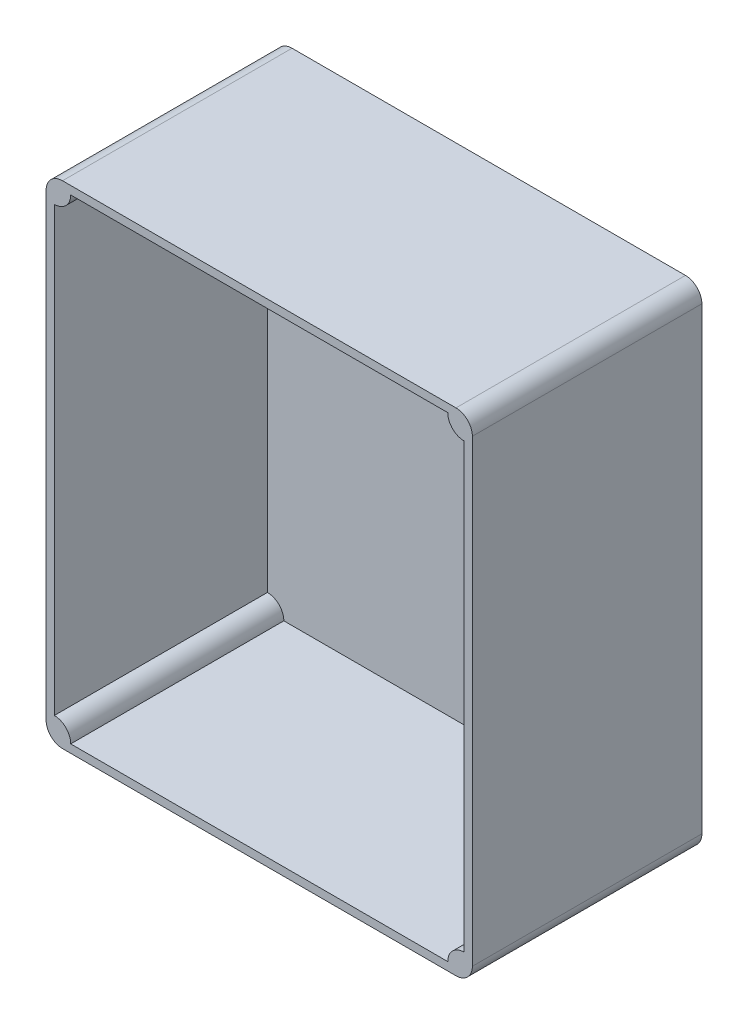
ISO-10303-21;
HEADER;
FILE_DESCRIPTION(('STEP AP214'),'2;1');
FILE_NAME('part.step','',(''),(''),'','','');
FILE_SCHEMA(('AUTOMOTIVE_DESIGN { 1 0 10303 214 1 1 1 1 }'));
ENDSEC;
DATA;
#1=APPLICATION_CONTEXT('core data for automotive mechanical design processes');
#2=APPLICATION_PROTOCOL_DEFINITION('international standard','automotive_design',2000,#1);
#3=PRODUCT_CONTEXT('',#1,'mechanical');
#4=PRODUCT('Part','Part','',(#3));
#5=PRODUCT_RELATED_PRODUCT_CATEGORY('part','',(#4));
#6=PRODUCT_DEFINITION_FORMATION('','',#4);
#7=PRODUCT_DEFINITION_CONTEXT('part definition',#1,'design');
#8=PRODUCT_DEFINITION('design','',#6,#7);
#9=PRODUCT_DEFINITION_SHAPE('','',#8);
#10=(LENGTH_UNIT() NAMED_UNIT(*) SI_UNIT(.MILLI.,.METRE.));
#11=(NAMED_UNIT(*) PLANE_ANGLE_UNIT() SI_UNIT($,.RADIAN.));
#12=(NAMED_UNIT(*) SI_UNIT($,.STERADIAN.) SOLID_ANGLE_UNIT());
#13=UNCERTAINTY_MEASURE_WITH_UNIT(LENGTH_MEASURE(1.E-05),#10,'distance_accuracy_value','');
#14=(GEOMETRIC_REPRESENTATION_CONTEXT(3) GLOBAL_UNCERTAINTY_ASSIGNED_CONTEXT((#13)) GLOBAL_UNIT_ASSIGNED_CONTEXT((#10,
#11,#12)) REPRESENTATION_CONTEXT('',''));
#15=CARTESIAN_POINT('',(0.,0.,0.));
#16=DIRECTION('',(0.,0.,1.));
#17=DIRECTION('',(1.,0.,0.));
#18=AXIS2_PLACEMENT_3D('',#15,#16,#17);
#19=CARTESIAN_POINT('',(0.,0.,35.));
#20=DIRECTION('',(0.,0.,1.));
#21=DIRECTION('',(1.,0.,0.));
#22=AXIS2_PLACEMENT_3D('',#19,#20,#21);
#23=PLANE('',#22);
#24=DIRECTION('',(-1.,0.,0.));
#25=VECTOR('',#24,1.);
#26=CARTESIAN_POINT('',(-65.,75.,35.));
#27=LINE('',#26,#25);
#28=CARTESIAN_POINT('',(60.,75.,35.));
#29=VERTEX_POINT('',#28);
#30=CARTESIAN_POINT('',(-60.,75.,35.));
#31=VERTEX_POINT('',#30);
#32=EDGE_CURVE('E255',#29,#31,#27,.T.);
#33=ORIENTED_EDGE('',*,*,#32,.T.);
#34=CARTESIAN_POINT('',(-60.,70.,35.));
#35=DIRECTION('',(0.,0.,1.));
#36=DIRECTION('',(1.,0.,0.));
#37=AXIS2_PLACEMENT_3D('',#34,#35,#36);
#38=CIRCLE('',#37,5.);
#39=CARTESIAN_POINT('',(-65.,70.,35.));
#40=VERTEX_POINT('',#39);
#41=EDGE_CURVE('E313',#31,#40,#38,.T.);
#42=ORIENTED_EDGE('',*,*,#41,.T.);
#43=DIRECTION('',(0.,-1.,0.));
#44=VECTOR('',#43,1.);
#45=CARTESIAN_POINT('',(-65.,75.,35.));
#46=LINE('',#45,#44);
#47=CARTESIAN_POINT('',(-65.,-70.,35.));
#48=VERTEX_POINT('',#47);
#49=EDGE_CURVE('E260',#40,#48,#46,.T.);
#50=ORIENTED_EDGE('',*,*,#49,.T.);
#51=CARTESIAN_POINT('',(-60.,-70.,35.));
#52=DIRECTION('',(0.,0.,1.));
#53=DIRECTION('',(1.,0.,0.));
#54=AXIS2_PLACEMENT_3D('',#51,#52,#53);
#55=CIRCLE('',#54,5.);
#56=CARTESIAN_POINT('',(-60.,-75.,35.));
#57=VERTEX_POINT('',#56);
#58=EDGE_CURVE('E60',#48,#57,#55,.T.);
#59=ORIENTED_EDGE('',*,*,#58,.T.);
#60=DIRECTION('',(1.,0.,0.));
#61=VECTOR('',#60,1.);
#62=CARTESIAN_POINT('',(-65.,-75.,35.));
#63=LINE('',#62,#61);
#64=CARTESIAN_POINT('',(60.,-75.,35.));
#65=VERTEX_POINT('',#64);
#66=EDGE_CURVE('E263',#57,#65,#63,.T.);
#67=ORIENTED_EDGE('',*,*,#66,.T.);
#68=CARTESIAN_POINT('',(60.,-70.,35.));
#69=DIRECTION('',(0.,0.,1.));
#70=DIRECTION('',(1.,0.,0.));
#71=AXIS2_PLACEMENT_3D('',#68,#69,#70);
#72=CIRCLE('',#71,5.);
#73=CARTESIAN_POINT('',(65.,-70.,35.));
#74=VERTEX_POINT('',#73);
#75=EDGE_CURVE('E307',#65,#74,#72,.T.);
#76=ORIENTED_EDGE('',*,*,#75,.T.);
#77=DIRECTION('',(0.,1.,0.));
#78=VECTOR('',#77,1.);
#79=CARTESIAN_POINT('',(65.,75.,35.));
#80=LINE('',#79,#78);
#81=CARTESIAN_POINT('',(65.,70.,35.));
#82=VERTEX_POINT('',#81);
#83=EDGE_CURVE('E251',#74,#82,#80,.T.);
#84=ORIENTED_EDGE('',*,*,#83,.T.);
#85=CARTESIAN_POINT('',(60.,70.,35.));
#86=DIRECTION('',(0.,0.,1.));
#87=DIRECTION('',(1.,0.,0.));
#88=AXIS2_PLACEMENT_3D('',#85,#86,#87);
#89=CIRCLE('',#88,5.);
#90=EDGE_CURVE('E310',#82,#29,#89,.T.);
#91=ORIENTED_EDGE('',*,*,#90,.T.);
#92=EDGE_LOOP('',(#33,#42,#50,#59,#67,#76,#84,#91));
#93=FACE_BOUND('',#92,.T.);
#94=DIRECTION('',(1.,0.,0.));
#95=VECTOR('',#94,1.);
#96=CARTESIAN_POINT('',(0.,72.5,35.));
#97=LINE('',#96,#95);
#98=CARTESIAN_POINT('',(-57.5,72.5,35.));
#99=VERTEX_POINT('',#98);
#100=CARTESIAN_POINT('',(57.5,72.5,35.));
#101=VERTEX_POINT('',#100);
#102=EDGE_CURVE('E208',#99,#101,#97,.T.);
#103=ORIENTED_EDGE('',*,*,#102,.T.);
#104=CARTESIAN_POINT('',(62.5,72.5,35.));
#105=DIRECTION('',(0.,0.,1.));
#106=DIRECTION('',(1.,0.,0.));
#107=AXIS2_PLACEMENT_3D('',#104,#105,#106);
#108=CIRCLE('',#107,5.);
#109=CARTESIAN_POINT('',(62.5,67.5,35.));
#110=VERTEX_POINT('',#109);
#111=EDGE_CURVE('E174',#101,#110,#108,.T.);
#112=ORIENTED_EDGE('',*,*,#111,.T.);
#113=DIRECTION('',(0.,-1.,0.));
#114=VECTOR('',#113,1.);
#115=CARTESIAN_POINT('',(62.5,0.,35.));
#116=LINE('',#115,#114);
#117=CARTESIAN_POINT('',(62.5,-67.5,35.));
#118=VERTEX_POINT('',#117);
#119=EDGE_CURVE('E181',#110,#118,#116,.T.);
#120=ORIENTED_EDGE('',*,*,#119,.T.);
#121=CARTESIAN_POINT('',(62.5,-72.5,35.));
#122=DIRECTION('',(0.,0.,1.));
#123=DIRECTION('',(1.,0.,0.));
#124=AXIS2_PLACEMENT_3D('',#121,#122,#123);
#125=CIRCLE('',#124,5.);
#126=CARTESIAN_POINT('',(57.5,-72.5,35.));
#127=VERTEX_POINT('',#126);
#128=EDGE_CURVE('E185',#118,#127,#125,.T.);
#129=ORIENTED_EDGE('',*,*,#128,.T.);
#130=DIRECTION('',(1.,0.,0.));
#131=VECTOR('',#130,1.);
#132=CARTESIAN_POINT('',(0.,-72.5,35.));
#133=LINE('',#132,#131);
#134=CARTESIAN_POINT('',(-57.5,-72.5,35.));
#135=VERTEX_POINT('',#134);
#136=EDGE_CURVE('E223',#135,#127,#133,.T.);
#137=ORIENTED_EDGE('',*,*,#136,.F.);
#138=CARTESIAN_POINT('',(-62.5,-72.5,35.));
#139=DIRECTION('',(0.,0.,1.));
#140=DIRECTION('',(1.,0.,0.));
#141=AXIS2_PLACEMENT_3D('',#138,#139,#140);
#142=CIRCLE('',#141,5.);
#143=CARTESIAN_POINT('',(-62.5,-67.5,35.));
#144=VERTEX_POINT('',#143);
#145=EDGE_CURVE('E219',#135,#144,#142,.T.);
#146=ORIENTED_EDGE('',*,*,#145,.T.);
#147=DIRECTION('',(0.,-1.,0.));
#148=VECTOR('',#147,1.);
#149=CARTESIAN_POINT('',(-62.5,0.,35.));
#150=LINE('',#149,#148);
#151=CARTESIAN_POINT('',(-62.5,67.5,35.));
#152=VERTEX_POINT('',#151);
#153=EDGE_CURVE('E215',#152,#144,#150,.T.);
#154=ORIENTED_EDGE('',*,*,#153,.F.);
#155=CARTESIAN_POINT('',(-62.5,72.5,35.));
#156=DIRECTION('',(0.,0.,1.));
#157=DIRECTION('',(1.,0.,0.));
#158=AXIS2_PLACEMENT_3D('',#155,#156,#157);
#159=CIRCLE('',#158,5.);
#160=EDGE_CURVE('E211',#99,#152,#159,.F.);
#161=ORIENTED_EDGE('',*,*,#160,.F.);
#162=EDGE_LOOP('',(#103,#112,#120,#129,#137,#146,#154,#161));
#163=FACE_BOUND('',#162,.T.);
#164=ADVANCED_FACE('F39',(#93,#163),#23,.T.);
#165=CARTESIAN_POINT('',(65.,75.,35.));
#166=DIRECTION('',(-1.,0.,0.));
#167=DIRECTION('',(0.,-1.,0.));
#168=AXIS2_PLACEMENT_3D('',#165,#166,#167);
#169=PLANE('',#168);
#170=DIRECTION('',(0.,1.,0.));
#171=VECTOR('',#170,1.);
#172=CARTESIAN_POINT('',(65.,75.,-35.));
#173=LINE('',#172,#171);
#174=CARTESIAN_POINT('',(65.,-70.,-35.));
#175=VERTEX_POINT('',#174);
#176=CARTESIAN_POINT('',(65.,70.,-35.));
#177=VERTEX_POINT('',#176);
#178=EDGE_CURVE('E233',#175,#177,#173,.T.);
#179=ORIENTED_EDGE('',*,*,#178,.T.);
#180=DIRECTION('',(0.,0.,-1.));
#181=VECTOR('',#180,1.);
#182=CARTESIAN_POINT('',(65.,70.,35.));
#183=LINE('',#182,#181);
#184=EDGE_CURVE('E320',#177,#82,#183,.F.);
#185=ORIENTED_EDGE('',*,*,#184,.T.);
#186=ORIENTED_EDGE('',*,*,#83,.F.);
#187=DIRECTION('',(0.,0.,-1.));
#188=VECTOR('',#187,1.);
#189=CARTESIAN_POINT('',(65.,-70.,35.));
#190=LINE('',#189,#188);
#191=EDGE_CURVE('E316',#74,#175,#190,.T.);
#192=ORIENTED_EDGE('',*,*,#191,.T.);
#193=EDGE_LOOP('',(#179,#185,#186,#192));
#194=FACE_BOUND('',#193,.T.);
#195=ADVANCED_FACE('F338',(#194),#169,.F.);
#196=CARTESIAN_POINT('',(-65.,75.,35.));
#197=DIRECTION('',(0.,-1.,0.));
#198=DIRECTION('',(0.,0.,-1.));
#199=AXIS2_PLACEMENT_3D('',#196,#197,#198);
#200=PLANE('',#199);
#201=DIRECTION('',(-1.,0.,0.));
#202=VECTOR('',#201,1.);
#203=CARTESIAN_POINT('',(-65.,75.,-35.));
#204=LINE('',#203,#202);
#205=CARTESIAN_POINT('',(60.,75.,-35.));
#206=VERTEX_POINT('',#205);
#207=CARTESIAN_POINT('',(-60.,75.,-35.));
#208=VERTEX_POINT('',#207);
#209=EDGE_CURVE('E270',#206,#208,#204,.T.);
#210=ORIENTED_EDGE('',*,*,#209,.T.);
#211=DIRECTION('',(0.,0.,-1.));
#212=VECTOR('',#211,1.);
#213=CARTESIAN_POINT('',(-60.,75.,35.));
#214=LINE('',#213,#212);
#215=EDGE_CURVE('E302',#208,#31,#214,.F.);
#216=ORIENTED_EDGE('',*,*,#215,.T.);
#217=ORIENTED_EDGE('',*,*,#32,.F.);
#218=DIRECTION('',(0.,0.,-1.));
#219=VECTOR('',#218,1.);
#220=CARTESIAN_POINT('',(60.,75.,35.));
#221=LINE('',#220,#219);
#222=EDGE_CURVE('E298',#29,#206,#221,.T.);
#223=ORIENTED_EDGE('',*,*,#222,.T.);
#224=EDGE_LOOP('',(#210,#216,#217,#223));
#225=FACE_BOUND('',#224,.T.);
#226=ADVANCED_FACE('F348',(#225),#200,.F.);
#227=CARTESIAN_POINT('',(-65.,75.,35.));
#228=DIRECTION('',(1.,0.,0.));
#229=DIRECTION('',(0.,1.,0.));
#230=AXIS2_PLACEMENT_3D('',#227,#228,#229);
#231=PLANE('',#230);
#232=ORIENTED_EDGE('',*,*,#49,.F.);
#233=DIRECTION('',(0.,0.,-1.));
#234=VECTOR('',#233,1.);
#235=CARTESIAN_POINT('',(-65.,70.,35.));
#236=LINE('',#235,#234);
#237=CARTESIAN_POINT('',(-65.,70.,-35.));
#238=VERTEX_POINT('',#237);
#239=EDGE_CURVE('E282',#40,#238,#236,.T.);
#240=ORIENTED_EDGE('',*,*,#239,.T.);
#241=DIRECTION('',(0.,-1.,0.));
#242=VECTOR('',#241,1.);
#243=CARTESIAN_POINT('',(-65.,75.,-35.));
#244=LINE('',#243,#242);
#245=CARTESIAN_POINT('',(-65.,-70.,-35.));
#246=VERTEX_POINT('',#245);
#247=EDGE_CURVE('E274',#238,#246,#244,.T.);
#248=ORIENTED_EDGE('',*,*,#247,.T.);
#249=DIRECTION('',(0.,0.,-1.));
#250=VECTOR('',#249,1.);
#251=CARTESIAN_POINT('',(-65.,-70.,35.));
#252=LINE('',#251,#250);
#253=EDGE_CURVE('E266',#246,#48,#252,.F.);
#254=ORIENTED_EDGE('',*,*,#253,.T.);
#255=EDGE_LOOP('',(#232,#240,#248,#254));
#256=FACE_BOUND('',#255,.T.);
#257=ADVANCED_FACE('F356',(#256),#231,.F.);
#258=CARTESIAN_POINT('',(-65.,-75.,35.));
#259=DIRECTION('',(0.,1.,0.));
#260=DIRECTION('',(0.,0.,1.));
#261=AXIS2_PLACEMENT_3D('',#258,#259,#260);
#262=PLANE('',#261);
#263=DIRECTION('',(1.,0.,0.));
#264=VECTOR('',#263,1.);
#265=CARTESIAN_POINT('',(-65.,-75.,-35.));
#266=LINE('',#265,#264);
#267=CARTESIAN_POINT('',(-60.,-75.,-35.));
#268=VERTEX_POINT('',#267);
#269=CARTESIAN_POINT('',(60.,-75.,-35.));
#270=VERTEX_POINT('',#269);
#271=EDGE_CURVE('E256',#268,#270,#266,.T.);
#272=ORIENTED_EDGE('',*,*,#271,.T.);
#273=DIRECTION('',(0.,0.,-1.));
#274=VECTOR('',#273,1.);
#275=CARTESIAN_POINT('',(60.,-75.,35.));
#276=LINE('',#275,#274);
#277=EDGE_CURVE('E11',#270,#65,#276,.F.);
#278=ORIENTED_EDGE('',*,*,#277,.T.);
#279=ORIENTED_EDGE('',*,*,#66,.F.);
#280=DIRECTION('',(0.,0.,-1.));
#281=VECTOR('',#280,1.);
#282=CARTESIAN_POINT('',(-60.,-75.,35.));
#283=LINE('',#282,#281);
#284=EDGE_CURVE('E48',#57,#268,#283,.T.);
#285=ORIENTED_EDGE('',*,*,#284,.T.);
#286=EDGE_LOOP('',(#272,#278,#279,#285));
#287=FACE_BOUND('',#286,.T.);
#288=ADVANCED_FACE('F326',(#287),#262,.F.);
#289=CARTESIAN_POINT('',(0.,0.,-35.));
#290=DIRECTION('',(0.,0.,1.));
#291=DIRECTION('',(1.,0.,0.));
#292=AXIS2_PLACEMENT_3D('',#289,#290,#291);
#293=PLANE('',#292);
#294=ORIENTED_EDGE('',*,*,#247,.F.);
#295=CARTESIAN_POINT('',(-60.,70.,-35.));
#296=DIRECTION('',(0.,0.,1.));
#297=DIRECTION('',(1.,0.,0.));
#298=AXIS2_PLACEMENT_3D('',#295,#296,#297);
#299=CIRCLE('',#298,5.);
#300=EDGE_CURVE('E295',#238,#208,#299,.F.);
#301=ORIENTED_EDGE('',*,*,#300,.T.);
#302=ORIENTED_EDGE('',*,*,#209,.F.);
#303=CARTESIAN_POINT('',(60.,70.,-35.));
#304=DIRECTION('',(0.,0.,1.));
#305=DIRECTION('',(1.,0.,0.));
#306=AXIS2_PLACEMENT_3D('',#303,#304,#305);
#307=CIRCLE('',#306,5.);
#308=EDGE_CURVE('E292',#206,#177,#307,.F.);
#309=ORIENTED_EDGE('',*,*,#308,.T.);
#310=ORIENTED_EDGE('',*,*,#178,.F.);
#311=CARTESIAN_POINT('',(60.,-70.,-35.));
#312=DIRECTION('',(0.,0.,1.));
#313=DIRECTION('',(1.,0.,0.));
#314=AXIS2_PLACEMENT_3D('',#311,#312,#313);
#315=CIRCLE('',#314,5.);
#316=EDGE_CURVE('E289',#175,#270,#315,.F.);
#317=ORIENTED_EDGE('',*,*,#316,.T.);
#318=ORIENTED_EDGE('',*,*,#271,.F.);
#319=CARTESIAN_POINT('',(-60.,-70.,-35.));
#320=DIRECTION('',(0.,0.,1.));
#321=DIRECTION('',(1.,0.,0.));
#322=AXIS2_PLACEMENT_3D('',#319,#320,#321);
#323=CIRCLE('',#322,5.);
#324=EDGE_CURVE('E286',#268,#246,#323,.F.);
#325=ORIENTED_EDGE('',*,*,#324,.T.);
#326=EDGE_LOOP('',(#294,#301,#302,#309,#310,#317,#318,#325));
#327=FACE_BOUND('',#326,.T.);
#328=ADVANCED_FACE('F330',(#327),#293,.F.);
#329=CARTESIAN_POINT('',(62.5,72.5,-30.));
#330=DIRECTION('',(0.,0.,1.));
#331=DIRECTION('',(1.,0.,0.));
#332=AXIS2_PLACEMENT_3D('',#329,#330,#331);
#333=CYLINDRICAL_SURFACE('',#332,5.);
#334=ORIENTED_EDGE('',*,*,#111,.F.);
#335=DIRECTION('',(0.,0.,1.));
#336=VECTOR('',#335,1.);
#337=CARTESIAN_POINT('',(57.5,72.5,-30.));
#338=LINE('',#337,#336);
#339=CARTESIAN_POINT('',(57.5,72.5,-30.));
#340=VERTEX_POINT('',#339);
#341=EDGE_CURVE('E157',#340,#101,#338,.T.);
#342=ORIENTED_EDGE('',*,*,#341,.F.);
#343=CARTESIAN_POINT('',(62.5,72.5,-30.));
#344=DIRECTION('',(0.,0.,1.));
#345=DIRECTION('',(1.,0.,0.));
#346=AXIS2_PLACEMENT_3D('',#343,#344,#345);
#347=CIRCLE('',#346,5.);
#348=CARTESIAN_POINT('',(62.5,67.5,-30.));
#349=VERTEX_POINT('',#348);
#350=EDGE_CURVE('E166',#340,#349,#347,.T.);
#351=ORIENTED_EDGE('',*,*,#350,.T.);
#352=DIRECTION('',(0.,0.,1.));
#353=VECTOR('',#352,1.);
#354=CARTESIAN_POINT('',(62.5,67.5,-30.));
#355=LINE('',#354,#353);
#356=EDGE_CURVE('E230',#349,#110,#355,.T.);
#357=ORIENTED_EDGE('',*,*,#356,.T.);
#358=EDGE_LOOP('',(#334,#342,#351,#357));
#359=FACE_BOUND('',#358,.T.);
#360=ADVANCED_FACE('F170',(#359),#333,.T.);
#361=CARTESIAN_POINT('',(62.5,0.,-30.));
#362=DIRECTION('',(-1.,0.,0.));
#363=DIRECTION('',(0.,-1.,0.));
#364=AXIS2_PLACEMENT_3D('',#361,#362,#363);
#365=PLANE('',#364);
#366=ORIENTED_EDGE('',*,*,#119,.F.);
#367=ORIENTED_EDGE('',*,*,#356,.F.);
#368=DIRECTION('',(0.,-1.,0.));
#369=VECTOR('',#368,1.);
#370=CARTESIAN_POINT('',(62.5,0.,-30.));
#371=LINE('',#370,#369);
#372=CARTESIAN_POINT('',(62.5,-67.5,-30.));
#373=VERTEX_POINT('',#372);
#374=EDGE_CURVE('E176',#349,#373,#371,.T.);
#375=ORIENTED_EDGE('',*,*,#374,.T.);
#376=DIRECTION('',(0.,0.,1.));
#377=VECTOR('',#376,1.);
#378=CARTESIAN_POINT('',(62.5,-67.5,-30.));
#379=LINE('',#378,#377);
#380=EDGE_CURVE('E234',#373,#118,#379,.T.);
#381=ORIENTED_EDGE('',*,*,#380,.T.);
#382=EDGE_LOOP('',(#366,#367,#375,#381));
#383=FACE_BOUND('',#382,.T.);
#384=ADVANCED_FACE('F461',(#383),#365,.T.);
#385=CARTESIAN_POINT('',(62.5,-72.5,-30.));
#386=DIRECTION('',(0.,0.,1.));
#387=DIRECTION('',(1.,0.,0.));
#388=AXIS2_PLACEMENT_3D('',#385,#386,#387);
#389=CYLINDRICAL_SURFACE('',#388,5.);
#390=ORIENTED_EDGE('',*,*,#128,.F.);
#391=ORIENTED_EDGE('',*,*,#380,.F.);
#392=CARTESIAN_POINT('',(62.5,-72.5,-30.));
#393=DIRECTION('',(0.,0.,1.));
#394=DIRECTION('',(1.,0.,0.));
#395=AXIS2_PLACEMENT_3D('',#392,#393,#394);
#396=CIRCLE('',#395,5.);
#397=CARTESIAN_POINT('',(57.5,-72.5,-30.));
#398=VERTEX_POINT('',#397);
#399=EDGE_CURVE('E201',#373,#398,#396,.T.);
#400=ORIENTED_EDGE('',*,*,#399,.T.);
#401=DIRECTION('',(0.,0.,1.));
#402=VECTOR('',#401,1.);
#403=CARTESIAN_POINT('',(57.5,-72.5,-30.));
#404=LINE('',#403,#402);
#405=EDGE_CURVE('E237',#398,#127,#404,.T.);
#406=ORIENTED_EDGE('',*,*,#405,.T.);
#407=EDGE_LOOP('',(#390,#391,#400,#406));
#408=FACE_BOUND('',#407,.T.);
#409=ADVANCED_FACE('F452',(#408),#389,.T.);
#410=CARTESIAN_POINT('',(0.,-72.5,-30.));
#411=DIRECTION('',(0.,-1.,0.));
#412=DIRECTION('',(0.,0.,-1.));
#413=AXIS2_PLACEMENT_3D('',#410,#411,#412);
#414=PLANE('',#413);
#415=ORIENTED_EDGE('',*,*,#136,.T.);
#416=ORIENTED_EDGE('',*,*,#405,.F.);
#417=DIRECTION('',(1.,0.,0.));
#418=VECTOR('',#417,1.);
#419=CARTESIAN_POINT('',(0.,-72.5,-30.));
#420=LINE('',#419,#418);
#421=CARTESIAN_POINT('',(-57.5,-72.5,-30.));
#422=VERTEX_POINT('',#421);
#423=EDGE_CURVE('E197',#422,#398,#420,.T.);
#424=ORIENTED_EDGE('',*,*,#423,.F.);
#425=DIRECTION('',(0.,0.,1.));
#426=VECTOR('',#425,1.);
#427=CARTESIAN_POINT('',(-57.5,-72.5,-30.));
#428=LINE('',#427,#426);
#429=EDGE_CURVE('E240',#422,#135,#428,.T.);
#430=ORIENTED_EDGE('',*,*,#429,.T.);
#431=EDGE_LOOP('',(#415,#416,#424,#430));
#432=FACE_BOUND('',#431,.T.);
#433=ADVANCED_FACE('F443',(#432),#414,.F.);
#434=CARTESIAN_POINT('',(-62.5,-72.5,-30.));
#435=DIRECTION('',(0.,0.,1.));
#436=DIRECTION('',(1.,0.,0.));
#437=AXIS2_PLACEMENT_3D('',#434,#435,#436);
#438=CYLINDRICAL_SURFACE('',#437,5.);
#439=ORIENTED_EDGE('',*,*,#145,.F.);
#440=ORIENTED_EDGE('',*,*,#429,.F.);
#441=CARTESIAN_POINT('',(-62.5,-72.5,-30.));
#442=DIRECTION('',(0.,0.,1.));
#443=DIRECTION('',(1.,0.,0.));
#444=AXIS2_PLACEMENT_3D('',#441,#442,#443);
#445=CIRCLE('',#444,5.);
#446=CARTESIAN_POINT('',(-62.5,-67.5,-30.));
#447=VERTEX_POINT('',#446);
#448=EDGE_CURVE('E194',#422,#447,#445,.T.);
#449=ORIENTED_EDGE('',*,*,#448,.T.);
#450=DIRECTION('',(0.,0.,1.));
#451=VECTOR('',#450,1.);
#452=CARTESIAN_POINT('',(-62.5,-67.5,-30.));
#453=LINE('',#452,#451);
#454=EDGE_CURVE('E243',#447,#144,#453,.T.);
#455=ORIENTED_EDGE('',*,*,#454,.T.);
#456=EDGE_LOOP('',(#439,#440,#449,#455));
#457=FACE_BOUND('',#456,.T.);
#458=ADVANCED_FACE('F434',(#457),#438,.T.);
#459=CARTESIAN_POINT('',(-62.5,0.,-30.));
#460=DIRECTION('',(-1.,0.,0.));
#461=DIRECTION('',(0.,-1.,0.));
#462=AXIS2_PLACEMENT_3D('',#459,#460,#461);
#463=PLANE('',#462);
#464=ORIENTED_EDGE('',*,*,#153,.T.);
#465=ORIENTED_EDGE('',*,*,#454,.F.);
#466=DIRECTION('',(0.,-1.,0.));
#467=VECTOR('',#466,1.);
#468=CARTESIAN_POINT('',(-62.5,0.,-30.));
#469=LINE('',#468,#467);
#470=CARTESIAN_POINT('',(-62.5,67.5,-30.));
#471=VERTEX_POINT('',#470);
#472=EDGE_CURVE('E190',#471,#447,#469,.T.);
#473=ORIENTED_EDGE('',*,*,#472,.F.);
#474=DIRECTION('',(0.,0.,1.));
#475=VECTOR('',#474,1.);
#476=CARTESIAN_POINT('',(-62.5,67.5,-30.));
#477=LINE('',#476,#475);
#478=EDGE_CURVE('E246',#471,#152,#477,.T.);
#479=ORIENTED_EDGE('',*,*,#478,.T.);
#480=EDGE_LOOP('',(#464,#465,#473,#479));
#481=FACE_BOUND('',#480,.T.);
#482=ADVANCED_FACE('F425',(#481),#463,.F.);
#483=CARTESIAN_POINT('',(-62.5,72.5,-30.));
#484=DIRECTION('',(0.,0.,1.));
#485=DIRECTION('',(1.,0.,0.));
#486=AXIS2_PLACEMENT_3D('',#483,#484,#485);
#487=CYLINDRICAL_SURFACE('',#486,5.);
#488=ORIENTED_EDGE('',*,*,#160,.T.);
#489=ORIENTED_EDGE('',*,*,#478,.F.);
#490=CARTESIAN_POINT('',(-62.5,72.5,-30.));
#491=DIRECTION('',(0.,0.,1.));
#492=DIRECTION('',(1.,0.,0.));
#493=AXIS2_PLACEMENT_3D('',#490,#491,#492);
#494=CIRCLE('',#493,5.);
#495=CARTESIAN_POINT('',(-57.5,72.5,-30.));
#496=VERTEX_POINT('',#495);
#497=EDGE_CURVE('E165',#496,#471,#494,.F.);
#498=ORIENTED_EDGE('',*,*,#497,.F.);
#499=DIRECTION('',(0.,0.,1.));
#500=VECTOR('',#499,1.);
#501=CARTESIAN_POINT('',(-57.5,72.5,-30.));
#502=LINE('',#501,#500);
#503=EDGE_CURVE('E159',#496,#99,#502,.T.);
#504=ORIENTED_EDGE('',*,*,#503,.T.);
#505=EDGE_LOOP('',(#488,#489,#498,#504));
#506=FACE_BOUND('',#505,.T.);
#507=ADVANCED_FACE('F418',(#506),#487,.T.);
#508=CARTESIAN_POINT('',(0.,72.5,-30.));
#509=DIRECTION('',(0.,-1.,0.));
#510=DIRECTION('',(0.,0.,-1.));
#511=AXIS2_PLACEMENT_3D('',#508,#509,#510);
#512=PLANE('',#511);
#513=ORIENTED_EDGE('',*,*,#102,.F.);
#514=ORIENTED_EDGE('',*,*,#503,.F.);
#515=DIRECTION('',(1.,0.,0.));
#516=VECTOR('',#515,1.);
#517=CARTESIAN_POINT('',(0.,72.5,-30.));
#518=LINE('',#517,#516);
#519=EDGE_CURVE('E153',#496,#340,#518,.T.);
#520=ORIENTED_EDGE('',*,*,#519,.T.);
#521=ORIENTED_EDGE('',*,*,#341,.T.);
#522=EDGE_LOOP('',(#513,#514,#520,#521));
#523=FACE_BOUND('',#522,.T.);
#524=ADVANCED_FACE('F156',(#523),#512,.T.);
#525=CARTESIAN_POINT('',(0.,0.,-30.));
#526=DIRECTION('',(0.,0.,1.));
#527=DIRECTION('',(1.,0.,0.));
#528=AXIS2_PLACEMENT_3D('',#525,#526,#527);
#529=PLANE('',#528);
#530=ORIENTED_EDGE('',*,*,#350,.F.);
#531=ORIENTED_EDGE('',*,*,#519,.F.);
#532=ORIENTED_EDGE('',*,*,#497,.T.);
#533=ORIENTED_EDGE('',*,*,#472,.T.);
#534=ORIENTED_EDGE('',*,*,#448,.F.);
#535=ORIENTED_EDGE('',*,*,#423,.T.);
#536=ORIENTED_EDGE('',*,*,#399,.F.);
#537=ORIENTED_EDGE('',*,*,#374,.F.);
#538=EDGE_LOOP('',(#530,#531,#532,#533,#534,#535,#536,#537));
#539=FACE_BOUND('',#538,.T.);
#540=ADVANCED_FACE('F178',(#539),#529,.T.);
#541=CARTESIAN_POINT('',(-60.,70.,35.));
#542=DIRECTION('',(0.,0.,-1.));
#543=DIRECTION('',(-1.,0.,0.));
#544=AXIS2_PLACEMENT_3D('',#541,#542,#543);
#545=CYLINDRICAL_SURFACE('',#544,5.);
#546=ORIENTED_EDGE('',*,*,#41,.F.);
#547=ORIENTED_EDGE('',*,*,#215,.F.);
#548=ORIENTED_EDGE('',*,*,#300,.F.);
#549=ORIENTED_EDGE('',*,*,#239,.F.);
#550=EDGE_LOOP('',(#546,#547,#548,#549));
#551=FACE_BOUND('',#550,.T.);
#552=ADVANCED_FACE('F353',(#551),#545,.T.);
#553=CARTESIAN_POINT('',(60.,70.,35.));
#554=DIRECTION('',(0.,0.,-1.));
#555=DIRECTION('',(-1.,0.,0.));
#556=AXIS2_PLACEMENT_3D('',#553,#554,#555);
#557=CYLINDRICAL_SURFACE('',#556,5.);
#558=ORIENTED_EDGE('',*,*,#90,.F.);
#559=ORIENTED_EDGE('',*,*,#184,.F.);
#560=ORIENTED_EDGE('',*,*,#308,.F.);
#561=ORIENTED_EDGE('',*,*,#222,.F.);
#562=EDGE_LOOP('',(#558,#559,#560,#561));
#563=FACE_BOUND('',#562,.T.);
#564=ADVANCED_FACE('F345',(#563),#557,.T.);
#565=CARTESIAN_POINT('',(60.,-70.,35.));
#566=DIRECTION('',(0.,0.,-1.));
#567=DIRECTION('',(-1.,0.,0.));
#568=AXIS2_PLACEMENT_3D('',#565,#566,#567);
#569=CYLINDRICAL_SURFACE('',#568,5.);
#570=ORIENTED_EDGE('',*,*,#75,.F.);
#571=ORIENTED_EDGE('',*,*,#277,.F.);
#572=ORIENTED_EDGE('',*,*,#316,.F.);
#573=ORIENTED_EDGE('',*,*,#191,.F.);
#574=EDGE_LOOP('',(#570,#571,#572,#573));
#575=FACE_BOUND('',#574,.T.);
#576=ADVANCED_FACE('F335',(#575),#569,.T.);
#577=CARTESIAN_POINT('',(-60.,-70.,35.));
#578=DIRECTION('',(0.,0.,-1.));
#579=DIRECTION('',(-1.,0.,0.));
#580=AXIS2_PLACEMENT_3D('',#577,#578,#579);
#581=CYLINDRICAL_SURFACE('',#580,5.);
#582=ORIENTED_EDGE('',*,*,#58,.F.);
#583=ORIENTED_EDGE('',*,*,#253,.F.);
#584=ORIENTED_EDGE('',*,*,#324,.F.);
#585=ORIENTED_EDGE('',*,*,#284,.F.);
#586=EDGE_LOOP('',(#582,#583,#584,#585));
#587=FACE_BOUND('',#586,.T.);
#588=ADVANCED_FACE('F41',(#587),#581,.T.);
#589=CLOSED_SHELL('',(#164,#195,#226,#257,#288,#328,#360,#384,#409,#433,#458,#482,#507,#524,
#540,#552,#564,#576,#588));
#590=MANIFOLD_SOLID_BREP('B2',#589);
#591=ADVANCED_BREP_SHAPE_REPRESENTATION('',(#18,#590),#14);
#592=SHAPE_DEFINITION_REPRESENTATION(#9,#591);
ENDSEC;
END-ISO-10303-21;
